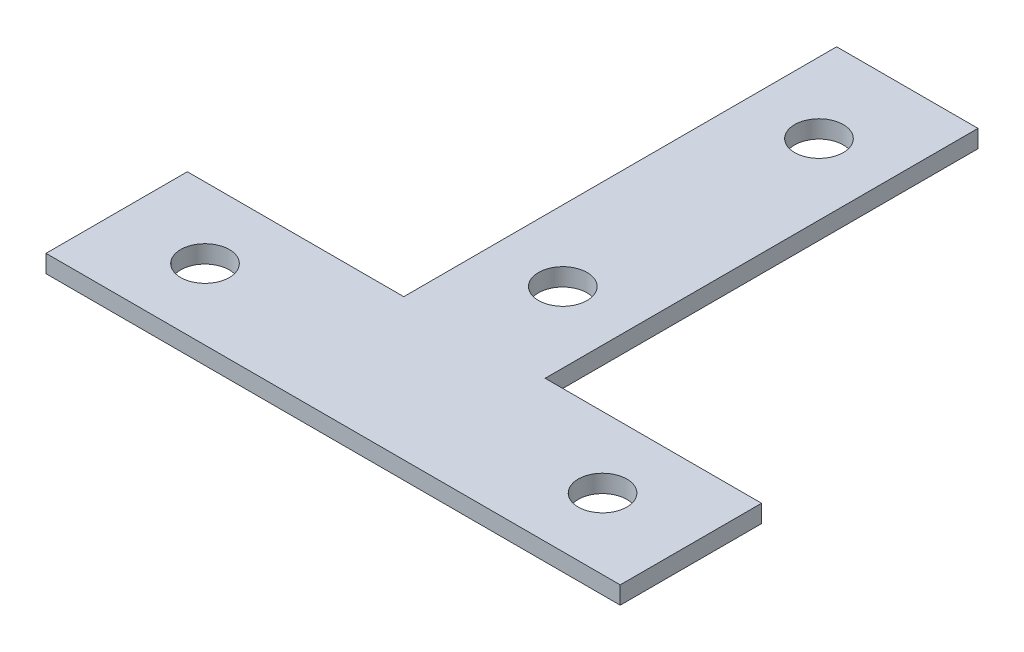
ISO-10303-21;
HEADER;
FILE_DESCRIPTION(('STEP AP214'),'2;1');
FILE_NAME('part.step','',(''),(''),'','','');
FILE_SCHEMA(('AUTOMOTIVE_DESIGN { 1 0 10303 214 1 1 1 1 }'));
ENDSEC;
DATA;
#1=APPLICATION_CONTEXT('core data for automotive mechanical design processes');
#2=APPLICATION_PROTOCOL_DEFINITION('international standard','automotive_design',2000,#1);
#3=PRODUCT_CONTEXT('',#1,'mechanical');
#4=PRODUCT('Part','Part','',(#3));
#5=PRODUCT_RELATED_PRODUCT_CATEGORY('part','',(#4));
#6=PRODUCT_DEFINITION_FORMATION('','',#4);
#7=PRODUCT_DEFINITION_CONTEXT('part definition',#1,'design');
#8=PRODUCT_DEFINITION('design','',#6,#7);
#9=PRODUCT_DEFINITION_SHAPE('','',#8);
#10=(LENGTH_UNIT() NAMED_UNIT(*) SI_UNIT(.MILLI.,.METRE.));
#11=(NAMED_UNIT(*) PLANE_ANGLE_UNIT() SI_UNIT($,.RADIAN.));
#12=(NAMED_UNIT(*) SI_UNIT($,.STERADIAN.) SOLID_ANGLE_UNIT());
#13=UNCERTAINTY_MEASURE_WITH_UNIT(LENGTH_MEASURE(1.E-05),#10,'distance_accuracy_value','');
#14=(GEOMETRIC_REPRESENTATION_CONTEXT(3) GLOBAL_UNCERTAINTY_ASSIGNED_CONTEXT((#13)) GLOBAL_UNIT_ASSIGNED_CONTEXT((#10,
#11,#12)) REPRESENTATION_CONTEXT('',''));
#15=CARTESIAN_POINT('',(0.,0.,0.));
#16=DIRECTION('',(0.,0.,1.));
#17=DIRECTION('',(1.,0.,0.));
#18=AXIS2_PLACEMENT_3D('',#15,#16,#17);
#19=CARTESIAN_POINT('',(0.,2.,0.));
#20=DIRECTION('',(0.,1.,0.));
#21=DIRECTION('',(0.,0.,1.));
#22=AXIS2_PLACEMENT_3D('',#19,#20,#21);
#23=PLANE('',#22);
#24=CARTESIAN_POINT('',(32.5,2.,-55.));
#25=DIRECTION('',(0.,1.,0.));
#26=DIRECTION('',(0.,0.,1.));
#27=AXIS2_PLACEMENT_3D('',#24,#25,#26);
#28=CIRCLE('',#27,2.75);
#29=CARTESIAN_POINT('',(32.5,2.,-52.25));
#30=VERTEX_POINT('',#29);
#31=EDGE_CURVE('E221',#30,#30,#28,.T.);
#32=ORIENTED_EDGE('',*,*,#31,.F.);
#33=EDGE_LOOP('',(#32));
#34=FACE_BOUND('',#33,.T.);
#35=CARTESIAN_POINT('',(10.,2.,-8.));
#36=DIRECTION('',(0.,1.,0.));
#37=DIRECTION('',(0.,0.,1.));
#38=AXIS2_PLACEMENT_3D('',#35,#36,#37);
#39=CIRCLE('',#38,2.75);
#40=CARTESIAN_POINT('',(10.,2.,-5.25));
#41=VERTEX_POINT('',#40);
#42=EDGE_CURVE('E146',#41,#41,#39,.T.);
#43=ORIENTED_EDGE('',*,*,#42,.F.);
#44=EDGE_LOOP('',(#43));
#45=FACE_BOUND('',#44,.T.);
#46=DIRECTION('',(0.,0.,1.));
#47=VECTOR('',#46,1.);
#48=CARTESIAN_POINT('',(0.,2.,-16.));
#49=LINE('',#48,#47);
#50=CARTESIAN_POINT('',(0.,2.,-16.));
#51=VERTEX_POINT('',#50);
#52=CARTESIAN_POINT('',(0.,2.,0.));
#53=VERTEX_POINT('',#52);
#54=EDGE_CURVE('E164',#51,#53,#49,.T.);
#55=ORIENTED_EDGE('',*,*,#54,.T.);
#56=DIRECTION('',(1.,0.,0.));
#57=VECTOR('',#56,1.);
#58=CARTESIAN_POINT('',(0.,2.,0.));
#59=LINE('',#58,#57);
#60=CARTESIAN_POINT('',(65.,2.,0.));
#61=VERTEX_POINT('',#60);
#62=EDGE_CURVE('E100',#53,#61,#59,.T.);
#63=ORIENTED_EDGE('',*,*,#62,.T.);
#64=DIRECTION('',(0.,0.,-1.));
#65=VECTOR('',#64,1.);
#66=CARTESIAN_POINT('',(65.,2.,0.));
#67=LINE('',#66,#65);
#68=CARTESIAN_POINT('',(65.,2.,-16.));
#69=VERTEX_POINT('',#68);
#70=EDGE_CURVE('E185',#61,#69,#67,.T.);
#71=ORIENTED_EDGE('',*,*,#70,.T.);
#72=DIRECTION('',(-1.,0.,0.));
#73=VECTOR('',#72,1.);
#74=CARTESIAN_POINT('',(65.,2.,-16.));
#75=LINE('',#74,#73);
#76=CARTESIAN_POINT('',(40.5,2.,-16.));
#77=VERTEX_POINT('',#76);
#78=EDGE_CURVE('E199',#69,#77,#75,.T.);
#79=ORIENTED_EDGE('',*,*,#78,.T.);
#80=DIRECTION('',(0.,0.,-1.));
#81=VECTOR('',#80,1.);
#82=CARTESIAN_POINT('',(40.5,2.,-16.));
#83=LINE('',#82,#81);
#84=CARTESIAN_POINT('',(40.5,2.,-65.));
#85=VERTEX_POINT('',#84);
#86=EDGE_CURVE('E119',#77,#85,#83,.T.);
#87=ORIENTED_EDGE('',*,*,#86,.T.);
#88=DIRECTION('',(-1.,0.,0.));
#89=VECTOR('',#88,1.);
#90=CARTESIAN_POINT('',(40.5,2.,-65.));
#91=LINE('',#90,#89);
#92=CARTESIAN_POINT('',(24.5,2.,-65.));
#93=VERTEX_POINT('',#92);
#94=EDGE_CURVE('E113',#85,#93,#91,.T.);
#95=ORIENTED_EDGE('',*,*,#94,.T.);
#96=DIRECTION('',(0.,0.,1.));
#97=VECTOR('',#96,1.);
#98=CARTESIAN_POINT('',(24.5,2.,-65.));
#99=LINE('',#98,#97);
#100=CARTESIAN_POINT('',(24.5,2.,-16.));
#101=VERTEX_POINT('',#100);
#102=EDGE_CURVE('E117',#93,#101,#99,.T.);
#103=ORIENTED_EDGE('',*,*,#102,.T.);
#104=DIRECTION('',(-1.,0.,0.));
#105=VECTOR('',#104,1.);
#106=CARTESIAN_POINT('',(24.5,2.,-16.));
#107=LINE('',#106,#105);
#108=EDGE_CURVE('E57',#101,#51,#107,.T.);
#109=ORIENTED_EDGE('',*,*,#108,.T.);
#110=EDGE_LOOP('',(#55,#63,#71,#79,#87,#95,#103,#109));
#111=FACE_BOUND('',#110,.T.);
#112=CARTESIAN_POINT('',(55.,2.,-8.));
#113=DIRECTION('',(0.,1.,0.));
#114=DIRECTION('',(0.,0.,1.));
#115=AXIS2_PLACEMENT_3D('',#112,#113,#114);
#116=CIRCLE('',#115,2.75);
#117=CARTESIAN_POINT('',(55.,2.,-5.25));
#118=VERTEX_POINT('',#117);
#119=EDGE_CURVE('E213',#118,#118,#116,.T.);
#120=ORIENTED_EDGE('',*,*,#119,.F.);
#121=EDGE_LOOP('',(#120));
#122=FACE_BOUND('',#121,.T.);
#123=CARTESIAN_POINT('',(32.5,2.,-26.));
#124=DIRECTION('',(0.,1.,0.));
#125=DIRECTION('',(0.,0.,1.));
#126=AXIS2_PLACEMENT_3D('',#123,#124,#125);
#127=CIRCLE('',#126,2.75);
#128=CARTESIAN_POINT('',(32.5,2.,-23.25));
#129=VERTEX_POINT('',#128);
#130=EDGE_CURVE('E229',#129,#129,#127,.T.);
#131=ORIENTED_EDGE('',*,*,#130,.F.);
#132=EDGE_LOOP('',(#131));
#133=FACE_BOUND('',#132,.T.);
#134=ADVANCED_FACE('F39',(#34,#45,#111,#122,#133),#23,.T.);
#135=CARTESIAN_POINT('',(0.,0.,0.));
#136=DIRECTION('',(0.,1.,0.));
#137=DIRECTION('',(0.,0.,1.));
#138=AXIS2_PLACEMENT_3D('',#135,#136,#137);
#139=PLANE('',#138);
#140=DIRECTION('',(0.,0.,1.));
#141=VECTOR('',#140,1.);
#142=CARTESIAN_POINT('',(0.,0.,-16.));
#143=LINE('',#142,#141);
#144=CARTESIAN_POINT('',(0.,0.,-16.));
#145=VERTEX_POINT('',#144);
#146=CARTESIAN_POINT('',(0.,0.,0.));
#147=VERTEX_POINT('',#146);
#148=EDGE_CURVE('E141',#145,#147,#143,.T.);
#149=ORIENTED_EDGE('',*,*,#148,.F.);
#150=DIRECTION('',(-1.,0.,0.));
#151=VECTOR('',#150,1.);
#152=CARTESIAN_POINT('',(24.5,0.,-16.));
#153=LINE('',#152,#151);
#154=CARTESIAN_POINT('',(24.5,0.,-16.));
#155=VERTEX_POINT('',#154);
#156=EDGE_CURVE('E92',#155,#145,#153,.T.);
#157=ORIENTED_EDGE('',*,*,#156,.F.);
#158=DIRECTION('',(0.,0.,1.));
#159=VECTOR('',#158,1.);
#160=CARTESIAN_POINT('',(24.5,0.,-65.));
#161=LINE('',#160,#159);
#162=CARTESIAN_POINT('',(24.5,0.,-65.));
#163=VERTEX_POINT('',#162);
#164=EDGE_CURVE('E86',#163,#155,#161,.T.);
#165=ORIENTED_EDGE('',*,*,#164,.F.);
#166=DIRECTION('',(-1.,0.,0.));
#167=VECTOR('',#166,1.);
#168=CARTESIAN_POINT('',(40.5,0.,-65.));
#169=LINE('',#168,#167);
#170=CARTESIAN_POINT('',(40.5,0.,-65.));
#171=VERTEX_POINT('',#170);
#172=EDGE_CURVE('E128',#171,#163,#169,.T.);
#173=ORIENTED_EDGE('',*,*,#172,.F.);
#174=DIRECTION('',(0.,0.,-1.));
#175=VECTOR('',#174,1.);
#176=CARTESIAN_POINT('',(40.5,0.,-16.));
#177=LINE('',#176,#175);
#178=CARTESIAN_POINT('',(40.5,0.,-16.));
#179=VERTEX_POINT('',#178);
#180=EDGE_CURVE('E155',#179,#171,#177,.T.);
#181=ORIENTED_EDGE('',*,*,#180,.F.);
#182=DIRECTION('',(-1.,0.,0.));
#183=VECTOR('',#182,1.);
#184=CARTESIAN_POINT('',(65.,0.,-16.));
#185=LINE('',#184,#183);
#186=CARTESIAN_POINT('',(65.,0.,-16.));
#187=VERTEX_POINT('',#186);
#188=EDGE_CURVE('E152',#187,#179,#185,.T.);
#189=ORIENTED_EDGE('',*,*,#188,.F.);
#190=DIRECTION('',(0.,0.,-1.));
#191=VECTOR('',#190,1.);
#192=CARTESIAN_POINT('',(65.,0.,0.));
#193=LINE('',#192,#191);
#194=CARTESIAN_POINT('',(65.,0.,0.));
#195=VERTEX_POINT('',#194);
#196=EDGE_CURVE('E149',#195,#187,#193,.T.);
#197=ORIENTED_EDGE('',*,*,#196,.F.);
#198=DIRECTION('',(1.,0.,0.));
#199=VECTOR('',#198,1.);
#200=CARTESIAN_POINT('',(0.,0.,0.));
#201=LINE('',#200,#199);
#202=EDGE_CURVE('E145',#147,#195,#201,.T.);
#203=ORIENTED_EDGE('',*,*,#202,.F.);
#204=EDGE_LOOP('',(#149,#157,#165,#173,#181,#189,#197,#203));
#205=FACE_BOUND('',#204,.T.);
#206=CARTESIAN_POINT('',(10.,0.,-8.));
#207=DIRECTION('',(0.,1.,0.));
#208=DIRECTION('',(0.,0.,1.));
#209=AXIS2_PLACEMENT_3D('',#206,#207,#208);
#210=CIRCLE('',#209,2.75);
#211=CARTESIAN_POINT('',(10.,0.,-5.25));
#212=VERTEX_POINT('',#211);
#213=EDGE_CURVE('E209',#212,#212,#210,.T.);
#214=ORIENTED_EDGE('',*,*,#213,.T.);
#215=EDGE_LOOP('',(#214));
#216=FACE_BOUND('',#215,.T.);
#217=CARTESIAN_POINT('',(55.,0.,-8.));
#218=DIRECTION('',(0.,1.,0.));
#219=DIRECTION('',(0.,0.,1.));
#220=AXIS2_PLACEMENT_3D('',#217,#218,#219);
#221=CIRCLE('',#220,2.75);
#222=CARTESIAN_POINT('',(55.,0.,-5.25));
#223=VERTEX_POINT('',#222);
#224=EDGE_CURVE('E217',#223,#223,#221,.T.);
#225=ORIENTED_EDGE('',*,*,#224,.T.);
#226=EDGE_LOOP('',(#225));
#227=FACE_BOUND('',#226,.T.);
#228=CARTESIAN_POINT('',(32.5,0.,-55.));
#229=DIRECTION('',(0.,1.,0.));
#230=DIRECTION('',(0.,0.,1.));
#231=AXIS2_PLACEMENT_3D('',#228,#229,#230);
#232=CIRCLE('',#231,2.75);
#233=CARTESIAN_POINT('',(32.5,0.,-52.25));
#234=VERTEX_POINT('',#233);
#235=EDGE_CURVE('E225',#234,#234,#232,.T.);
#236=ORIENTED_EDGE('',*,*,#235,.T.);
#237=EDGE_LOOP('',(#236));
#238=FACE_BOUND('',#237,.T.);
#239=CARTESIAN_POINT('',(32.5,0.,-26.));
#240=DIRECTION('',(0.,1.,0.));
#241=DIRECTION('',(0.,0.,1.));
#242=AXIS2_PLACEMENT_3D('',#239,#240,#241);
#243=CIRCLE('',#242,2.75);
#244=CARTESIAN_POINT('',(32.5,0.,-23.25));
#245=VERTEX_POINT('',#244);
#246=EDGE_CURVE('E233',#245,#245,#243,.T.);
#247=ORIENTED_EDGE('',*,*,#246,.T.);
#248=EDGE_LOOP('',(#247));
#249=FACE_BOUND('',#248,.T.);
#250=ADVANCED_FACE('F189',(#205,#216,#227,#238,#249),#139,.F.);
#251=CARTESIAN_POINT('',(0.,2.,-16.));
#252=DIRECTION('',(1.,0.,0.));
#253=DIRECTION('',(0.,0.,-1.));
#254=AXIS2_PLACEMENT_3D('',#251,#252,#253);
#255=PLANE('',#254);
#256=ORIENTED_EDGE('',*,*,#148,.T.);
#257=DIRECTION('',(0.,-1.,0.));
#258=VECTOR('',#257,1.);
#259=CARTESIAN_POINT('',(0.,2.,0.));
#260=LINE('',#259,#258);
#261=EDGE_CURVE('E11',#53,#147,#260,.T.);
#262=ORIENTED_EDGE('',*,*,#261,.F.);
#263=ORIENTED_EDGE('',*,*,#54,.F.);
#264=DIRECTION('',(0.,-1.,0.));
#265=VECTOR('',#264,1.);
#266=CARTESIAN_POINT('',(0.,2.,-16.));
#267=LINE('',#266,#265);
#268=EDGE_CURVE('E137',#51,#145,#267,.T.);
#269=ORIENTED_EDGE('',*,*,#268,.T.);
#270=EDGE_LOOP('',(#256,#262,#263,#269));
#271=FACE_BOUND('',#270,.T.);
#272=ADVANCED_FACE('F41',(#271),#255,.F.);
#273=CARTESIAN_POINT('',(0.,2.,0.));
#274=DIRECTION('',(0.,0.,-1.));
#275=DIRECTION('',(-1.,0.,0.));
#276=AXIS2_PLACEMENT_3D('',#273,#274,#275);
#277=PLANE('',#276);
#278=ORIENTED_EDGE('',*,*,#202,.T.);
#279=DIRECTION('',(0.,-1.,0.));
#280=VECTOR('',#279,1.);
#281=CARTESIAN_POINT('',(65.,2.,0.));
#282=LINE('',#281,#280);
#283=EDGE_CURVE('E49',#61,#195,#282,.T.);
#284=ORIENTED_EDGE('',*,*,#283,.F.);
#285=ORIENTED_EDGE('',*,*,#62,.F.);
#286=ORIENTED_EDGE('',*,*,#261,.T.);
#287=EDGE_LOOP('',(#278,#284,#285,#286));
#288=FACE_BOUND('',#287,.T.);
#289=ADVANCED_FACE('F269',(#288),#277,.F.);
#290=CARTESIAN_POINT('',(65.,2.,0.));
#291=DIRECTION('',(-1.,0.,0.));
#292=DIRECTION('',(0.,0.,1.));
#293=AXIS2_PLACEMENT_3D('',#290,#291,#292);
#294=PLANE('',#293);
#295=ORIENTED_EDGE('',*,*,#196,.T.);
#296=DIRECTION('',(0.,-1.,0.));
#297=VECTOR('',#296,1.);
#298=CARTESIAN_POINT('',(65.,2.,-16.));
#299=LINE('',#298,#297);
#300=EDGE_CURVE('E175',#69,#187,#299,.T.);
#301=ORIENTED_EDGE('',*,*,#300,.F.);
#302=ORIENTED_EDGE('',*,*,#70,.F.);
#303=ORIENTED_EDGE('',*,*,#283,.T.);
#304=EDGE_LOOP('',(#295,#301,#302,#303));
#305=FACE_BOUND('',#304,.T.);
#306=ADVANCED_FACE('F183',(#305),#294,.F.);
#307=CARTESIAN_POINT('',(65.,2.,-16.));
#308=DIRECTION('',(0.,0.,1.));
#309=DIRECTION('',(1.,0.,0.));
#310=AXIS2_PLACEMENT_3D('',#307,#308,#309);
#311=PLANE('',#310);
#312=ORIENTED_EDGE('',*,*,#188,.T.);
#313=DIRECTION('',(0.,-1.,0.));
#314=VECTOR('',#313,1.);
#315=CARTESIAN_POINT('',(40.5,2.,-16.));
#316=LINE('',#315,#314);
#317=EDGE_CURVE('E171',#77,#179,#316,.T.);
#318=ORIENTED_EDGE('',*,*,#317,.F.);
#319=ORIENTED_EDGE('',*,*,#78,.F.);
#320=ORIENTED_EDGE('',*,*,#300,.T.);
#321=EDGE_LOOP('',(#312,#318,#319,#320));
#322=FACE_BOUND('',#321,.T.);
#323=ADVANCED_FACE('F194',(#322),#311,.F.);
#324=CARTESIAN_POINT('',(40.5,2.,-16.));
#325=DIRECTION('',(-1.,0.,0.));
#326=DIRECTION('',(0.,0.,1.));
#327=AXIS2_PLACEMENT_3D('',#324,#325,#326);
#328=PLANE('',#327);
#329=ORIENTED_EDGE('',*,*,#180,.T.);
#330=DIRECTION('',(0.,-1.,0.));
#331=VECTOR('',#330,1.);
#332=CARTESIAN_POINT('',(40.5,2.,-65.));
#333=LINE('',#332,#331);
#334=EDGE_CURVE('E130',#85,#171,#333,.T.);
#335=ORIENTED_EDGE('',*,*,#334,.F.);
#336=ORIENTED_EDGE('',*,*,#86,.F.);
#337=ORIENTED_EDGE('',*,*,#317,.T.);
#338=EDGE_LOOP('',(#329,#335,#336,#337));
#339=FACE_BOUND('',#338,.T.);
#340=ADVANCED_FACE('F197',(#339),#328,.F.);
#341=CARTESIAN_POINT('',(40.5,2.,-65.));
#342=DIRECTION('',(0.,0.,1.));
#343=DIRECTION('',(1.,0.,0.));
#344=AXIS2_PLACEMENT_3D('',#341,#342,#343);
#345=PLANE('',#344);
#346=ORIENTED_EDGE('',*,*,#172,.T.);
#347=DIRECTION('',(0.,-1.,0.));
#348=VECTOR('',#347,1.);
#349=CARTESIAN_POINT('',(24.5,2.,-65.));
#350=LINE('',#349,#348);
#351=EDGE_CURVE('E125',#93,#163,#350,.T.);
#352=ORIENTED_EDGE('',*,*,#351,.F.);
#353=ORIENTED_EDGE('',*,*,#94,.F.);
#354=ORIENTED_EDGE('',*,*,#334,.T.);
#355=EDGE_LOOP('',(#346,#352,#353,#354));
#356=FACE_BOUND('',#355,.T.);
#357=ADVANCED_FACE('F126',(#356),#345,.F.);
#358=CARTESIAN_POINT('',(24.5,2.,-65.));
#359=DIRECTION('',(1.,0.,0.));
#360=DIRECTION('',(0.,0.,-1.));
#361=AXIS2_PLACEMENT_3D('',#358,#359,#360);
#362=PLANE('',#361);
#363=ORIENTED_EDGE('',*,*,#164,.T.);
#364=DIRECTION('',(0.,-1.,0.));
#365=VECTOR('',#364,1.);
#366=CARTESIAN_POINT('',(24.5,2.,-16.));
#367=LINE('',#366,#365);
#368=EDGE_CURVE('E131',#101,#155,#367,.T.);
#369=ORIENTED_EDGE('',*,*,#368,.F.);
#370=ORIENTED_EDGE('',*,*,#102,.F.);
#371=ORIENTED_EDGE('',*,*,#351,.T.);
#372=EDGE_LOOP('',(#363,#369,#370,#371));
#373=FACE_BOUND('',#372,.T.);
#374=ADVANCED_FACE('F133',(#373),#362,.F.);
#375=CARTESIAN_POINT('',(24.5,2.,-16.));
#376=DIRECTION('',(0.,0.,1.));
#377=DIRECTION('',(1.,0.,0.));
#378=AXIS2_PLACEMENT_3D('',#375,#376,#377);
#379=PLANE('',#378);
#380=ORIENTED_EDGE('',*,*,#156,.T.);
#381=ORIENTED_EDGE('',*,*,#268,.F.);
#382=ORIENTED_EDGE('',*,*,#108,.F.);
#383=ORIENTED_EDGE('',*,*,#368,.T.);
#384=EDGE_LOOP('',(#380,#381,#382,#383));
#385=FACE_BOUND('',#384,.T.);
#386=ADVANCED_FACE('F257',(#385),#379,.F.);
#387=CARTESIAN_POINT('',(10.,2.,-8.));
#388=DIRECTION('',(0.,-1.,0.));
#389=DIRECTION('',(0.,0.,-1.));
#390=AXIS2_PLACEMENT_3D('',#387,#388,#389);
#391=CYLINDRICAL_SURFACE('',#390,2.75);
#392=ORIENTED_EDGE('',*,*,#42,.T.);
#393=EDGE_LOOP('',(#392));
#394=FACE_BOUND('',#393,.T.);
#395=ORIENTED_EDGE('',*,*,#213,.F.);
#396=EDGE_LOOP('',(#395));
#397=FACE_BOUND('',#396,.T.);
#398=ADVANCED_FACE('F254',(#394,#397),#391,.F.);
#399=CARTESIAN_POINT('',(55.,2.,-8.));
#400=DIRECTION('',(0.,-1.,0.));
#401=DIRECTION('',(0.,0.,-1.));
#402=AXIS2_PLACEMENT_3D('',#399,#400,#401);
#403=CYLINDRICAL_SURFACE('',#402,2.75);
#404=ORIENTED_EDGE('',*,*,#119,.T.);
#405=EDGE_LOOP('',(#404));
#406=FACE_BOUND('',#405,.T.);
#407=ORIENTED_EDGE('',*,*,#224,.F.);
#408=EDGE_LOOP('',(#407));
#409=FACE_BOUND('',#408,.T.);
#410=ADVANCED_FACE('F333',(#406,#409),#403,.F.);
#411=CARTESIAN_POINT('',(32.5,2.,-55.));
#412=DIRECTION('',(0.,-1.,0.));
#413=DIRECTION('',(0.,0.,-1.));
#414=AXIS2_PLACEMENT_3D('',#411,#412,#413);
#415=CYLINDRICAL_SURFACE('',#414,2.75);
#416=ORIENTED_EDGE('',*,*,#31,.T.);
#417=EDGE_LOOP('',(#416));
#418=FACE_BOUND('',#417,.T.);
#419=ORIENTED_EDGE('',*,*,#235,.F.);
#420=EDGE_LOOP('',(#419));
#421=FACE_BOUND('',#420,.T.);
#422=ADVANCED_FACE('F341',(#418,#421),#415,.F.);
#423=CARTESIAN_POINT('',(32.5,2.,-26.));
#424=DIRECTION('',(0.,-1.,0.));
#425=DIRECTION('',(0.,0.,-1.));
#426=AXIS2_PLACEMENT_3D('',#423,#424,#425);
#427=CYLINDRICAL_SURFACE('',#426,2.75);
#428=ORIENTED_EDGE('',*,*,#130,.T.);
#429=EDGE_LOOP('',(#428));
#430=FACE_BOUND('',#429,.T.);
#431=ORIENTED_EDGE('',*,*,#246,.F.);
#432=EDGE_LOOP('',(#431));
#433=FACE_BOUND('',#432,.T.);
#434=ADVANCED_FACE('F241',(#430,#433),#427,.F.);
#435=CLOSED_SHELL('',(#134,#250,#272,#289,#306,#323,#340,#357,#374,#386,#398,#410,#422,#434));
#436=MANIFOLD_SOLID_BREP('B2',#435);
#437=ADVANCED_BREP_SHAPE_REPRESENTATION('',(#18,#436),#14);
#438=SHAPE_DEFINITION_REPRESENTATION(#9,#437);
ENDSEC;
END-ISO-10303-21;
